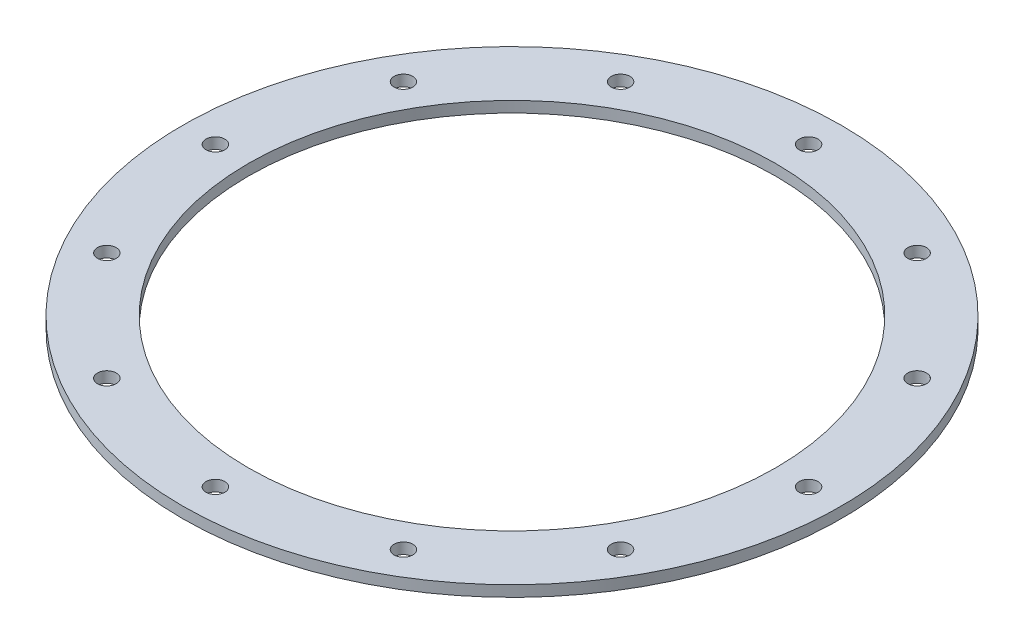
ISO-10303-21;
HEADER;
FILE_DESCRIPTION(('STEP AP214'),'2;1');
FILE_NAME('part.step','',(''),(''),'','','');
FILE_SCHEMA(('AUTOMOTIVE_DESIGN { 1 0 10303 214 1 1 1 1 }'));
ENDSEC;
DATA;
#1=APPLICATION_CONTEXT('core data for automotive mechanical design processes');
#2=APPLICATION_PROTOCOL_DEFINITION('international standard','automotive_design',2000,#1);
#3=PRODUCT_CONTEXT('',#1,'mechanical');
#4=PRODUCT('Part','Part','',(#3));
#5=PRODUCT_RELATED_PRODUCT_CATEGORY('part','',(#4));
#6=PRODUCT_DEFINITION_FORMATION('','',#4);
#7=PRODUCT_DEFINITION_CONTEXT('part definition',#1,'design');
#8=PRODUCT_DEFINITION('design','',#6,#7);
#9=PRODUCT_DEFINITION_SHAPE('','',#8);
#10=(LENGTH_UNIT() NAMED_UNIT(*) SI_UNIT(.MILLI.,.METRE.));
#11=(NAMED_UNIT(*) PLANE_ANGLE_UNIT() SI_UNIT($,.RADIAN.));
#12=(NAMED_UNIT(*) SI_UNIT($,.STERADIAN.) SOLID_ANGLE_UNIT());
#13=UNCERTAINTY_MEASURE_WITH_UNIT(LENGTH_MEASURE(1.E-05),#10,'distance_accuracy_value','');
#14=(GEOMETRIC_REPRESENTATION_CONTEXT(3) GLOBAL_UNCERTAINTY_ASSIGNED_CONTEXT((#13)) GLOBAL_UNIT_ASSIGNED_CONTEXT((#10,
#11,#12)) REPRESENTATION_CONTEXT('',''));
#15=CARTESIAN_POINT('',(0.,0.,0.));
#16=DIRECTION('',(0.,0.,1.));
#17=DIRECTION('',(1.,0.,0.));
#18=AXIS2_PLACEMENT_3D('',#15,#16,#17);
#19=CARTESIAN_POINT('',(-38.1,1.5875,0.));
#20=DIRECTION('',(0.,1.,0.));
#21=DIRECTION('',(0.,0.,1.));
#22=AXIS2_PLACEMENT_3D('',#19,#20,#21);
#23=PLANE('',#22);
#24=CARTESIAN_POINT('',(-21.4312500000004,1.58750000000001,37.1200138697103));
#25=DIRECTION('',(0.,-1.,0.));
#26=DIRECTION('',(0.,0.,-1.));
#27=AXIS2_PLACEMENT_3D('',#24,#25,#26);
#28=CIRCLE('',#27,1.35255);
#29=CARTESIAN_POINT('',(-21.4312500000004,1.58750000000001,35.7674638697103));
#30=VERTEX_POINT('',#29);
#31=EDGE_CURVE('E117',#30,#30,#28,.T.);
#32=ORIENTED_EDGE('',*,*,#31,.T.);
#33=EDGE_LOOP('',(#32));
#34=FACE_BOUND('',#33,.T.);
#35=CARTESIAN_POINT('',(21.4312499999997,1.58750000000001,37.1200138697107));
#36=DIRECTION('',(0.,-1.,0.));
#37=DIRECTION('',(0.,0.,-1.));
#38=AXIS2_PLACEMENT_3D('',#35,#36,#37);
#39=CIRCLE('',#38,1.35255);
#40=CARTESIAN_POINT('',(21.4312499999997,1.58750000000001,35.7674638697107));
#41=VERTEX_POINT('',#40);
#42=EDGE_CURVE('E105',#41,#41,#39,.T.);
#43=ORIENTED_EDGE('',*,*,#42,.T.);
#44=EDGE_LOOP('',(#43));
#45=FACE_BOUND('',#44,.T.);
#46=CARTESIAN_POINT('',(42.8625,1.58750000000001,2.36953774157887E-13));
#47=DIRECTION('',(0.,-1.,0.));
#48=DIRECTION('',(0.,0.,-1.));
#49=AXIS2_PLACEMENT_3D('',#46,#47,#48);
#50=CIRCLE('',#49,1.35255);
#51=CARTESIAN_POINT('',(42.8625,1.58750000000001,-1.35254999999976));
#52=VERTEX_POINT('',#51);
#53=EDGE_CURVE('E93',#52,#52,#50,.T.);
#54=ORIENTED_EDGE('',*,*,#53,.T.);
#55=EDGE_LOOP('',(#54));
#56=FACE_BOUND('',#55,.T.);
#57=CARTESIAN_POINT('',(21.4312500000001,1.58750000000001,-37.1200138697104));
#58=DIRECTION('',(0.,-1.,0.));
#59=DIRECTION('',(0.,0.,-1.));
#60=AXIS2_PLACEMENT_3D('',#57,#58,#59);
#61=CIRCLE('',#60,1.35255);
#62=CARTESIAN_POINT('',(21.4312500000001,1.58750000000001,-38.4725638697104));
#63=VERTEX_POINT('',#62);
#64=EDGE_CURVE('E81',#63,#63,#61,.T.);
#65=ORIENTED_EDGE('',*,*,#64,.T.);
#66=EDGE_LOOP('',(#65));
#67=FACE_BOUND('',#66,.T.);
#68=CARTESIAN_POINT('',(1.15852315907521E-13,1.58750000000001,-42.8625));
#69=DIRECTION('',(0.,-1.,0.));
#70=DIRECTION('',(0.,0.,-1.));
#71=AXIS2_PLACEMENT_3D('',#68,#69,#70);
#72=CIRCLE('',#71,1.35255);
#73=CARTESIAN_POINT('',(1.15852315907521E-13,1.58750000000001,-44.21505));
#74=VERTEX_POINT('',#73);
#75=EDGE_CURVE('E75',#74,#74,#72,.T.);
#76=ORIENTED_EDGE('',*,*,#75,.T.);
#77=EDGE_LOOP('',(#76));
#78=FACE_BOUND('',#77,.T.);
#79=CARTESIAN_POINT('',(-21.4312499999999,1.58750000000001,-37.1200138697105));
#80=DIRECTION('',(0.,-1.,0.));
#81=DIRECTION('',(0.,0.,-1.));
#82=AXIS2_PLACEMENT_3D('',#79,#80,#81);
#83=CIRCLE('',#82,1.35255);
#84=CARTESIAN_POINT('',(-21.4312499999999,1.58750000000001,-38.4725638697105));
#85=VERTEX_POINT('',#84);
#86=EDGE_CURVE('E69',#85,#85,#83,.T.);
#87=ORIENTED_EDGE('',*,*,#86,.T.);
#88=EDGE_LOOP('',(#87));
#89=FACE_BOUND('',#88,.T.);
#90=CARTESIAN_POINT('',(-37.1200138697105,1.58750000000001,-21.43125));
#91=DIRECTION('',(0.,-1.,0.));
#92=DIRECTION('',(0.,0.,-1.));
#93=AXIS2_PLACEMENT_3D('',#90,#91,#92);
#94=CIRCLE('',#93,1.35255);
#95=CARTESIAN_POINT('',(-37.1200138697105,1.58750000000001,-22.7838));
#96=VERTEX_POINT('',#95);
#97=EDGE_CURVE('E63',#96,#96,#94,.T.);
#98=ORIENTED_EDGE('',*,*,#97,.T.);
#99=EDGE_LOOP('',(#98));
#100=FACE_BOUND('',#99,.T.);
#101=CARTESIAN_POINT('',(-42.8625,1.58750000000001,0.));
#102=DIRECTION('',(0.,-1.,0.));
#103=DIRECTION('',(0.,0.,-1.));
#104=AXIS2_PLACEMENT_3D('',#101,#102,#103);
#105=CIRCLE('',#104,1.35255);
#106=CARTESIAN_POINT('',(-42.8625,1.58750000000001,-1.35255));
#107=VERTEX_POINT('',#106);
#108=EDGE_CURVE('E57',#107,#107,#105,.T.);
#109=ORIENTED_EDGE('',*,*,#108,.T.);
#110=EDGE_LOOP('',(#109));
#111=FACE_BOUND('',#110,.T.);
#112=CARTESIAN_POINT('',(0.,1.5875,0.));
#113=DIRECTION('',(0.,1.,0.));
#114=DIRECTION('',(0.,0.,1.));
#115=AXIS2_PLACEMENT_3D('',#112,#113,#114);
#116=CIRCLE('',#115,47.625);
#117=CARTESIAN_POINT('',(0.,1.5875,47.625));
#118=VERTEX_POINT('',#117);
#119=EDGE_CURVE('E44',#118,#118,#116,.T.);
#120=ORIENTED_EDGE('',*,*,#119,.T.);
#121=EDGE_LOOP('',(#120));
#122=FACE_BOUND('',#121,.T.);
#123=CARTESIAN_POINT('',(0.,1.58750000000001,0.));
#124=DIRECTION('',(0.,1.,0.));
#125=DIRECTION('',(0.,0.,1.));
#126=AXIS2_PLACEMENT_3D('',#123,#124,#125);
#127=CIRCLE('',#126,38.1);
#128=CARTESIAN_POINT('',(0.,1.58750000000001,38.1));
#129=VERTEX_POINT('',#128);
#130=EDGE_CURVE('E10',#129,#129,#127,.T.);
#131=ORIENTED_EDGE('',*,*,#130,.F.);
#132=EDGE_LOOP('',(#131));
#133=FACE_BOUND('',#132,.T.);
#134=CARTESIAN_POINT('',(37.1200138697106,1.58750000000001,-21.4312499999998));
#135=DIRECTION('',(0.,-1.,0.));
#136=DIRECTION('',(0.,0.,-1.));
#137=AXIS2_PLACEMENT_3D('',#134,#135,#136);
#138=CIRCLE('',#137,1.35255);
#139=CARTESIAN_POINT('',(37.1200138697106,1.58750000000001,-22.7837999999998));
#140=VERTEX_POINT('',#139);
#141=EDGE_CURVE('E87',#140,#140,#138,.T.);
#142=ORIENTED_EDGE('',*,*,#141,.T.);
#143=EDGE_LOOP('',(#142));
#144=FACE_BOUND('',#143,.T.);
#145=CARTESIAN_POINT('',(37.1200138697104,1.58750000000001,21.4312500000002));
#146=DIRECTION('',(0.,-1.,0.));
#147=DIRECTION('',(0.,0.,-1.));
#148=AXIS2_PLACEMENT_3D('',#145,#146,#147);
#149=CIRCLE('',#148,1.35255);
#150=CARTESIAN_POINT('',(37.1200138697104,1.58750000000001,20.0787000000002));
#151=VERTEX_POINT('',#150);
#152=EDGE_CURVE('E99',#151,#151,#149,.T.);
#153=ORIENTED_EDGE('',*,*,#152,.T.);
#154=EDGE_LOOP('',(#153));
#155=FACE_BOUND('',#154,.T.);
#156=CARTESIAN_POINT('',(-3.67572619286853E-13,1.58750000000001,42.8625));
#157=DIRECTION('',(0.,-1.,0.));
#158=DIRECTION('',(0.,0.,-1.));
#159=AXIS2_PLACEMENT_3D('',#156,#157,#158);
#160=CIRCLE('',#159,1.35255);
#161=CARTESIAN_POINT('',(-3.67572619286853E-13,1.58750000000001,41.50995));
#162=VERTEX_POINT('',#161);
#163=EDGE_CURVE('E111',#162,#162,#160,.T.);
#164=ORIENTED_EDGE('',*,*,#163,.T.);
#165=EDGE_LOOP('',(#164));
#166=FACE_BOUND('',#165,.T.);
#167=CARTESIAN_POINT('',(-37.1200138697107,1.58750000000001,21.4312499999996));
#168=DIRECTION('',(0.,-1.,0.));
#169=DIRECTION('',(0.,0.,-1.));
#170=AXIS2_PLACEMENT_3D('',#167,#168,#169);
#171=CIRCLE('',#170,1.35255);
#172=CARTESIAN_POINT('',(-37.1200138697107,1.58750000000001,20.0786999999996));
#173=VERTEX_POINT('',#172);
#174=EDGE_CURVE('E123',#173,#173,#171,.T.);
#175=ORIENTED_EDGE('',*,*,#174,.T.);
#176=EDGE_LOOP('',(#175));
#177=FACE_BOUND('',#176,.T.);
#178=ADVANCED_FACE('F37',(#34,#45,#56,#67,#78,#89,#100,#111,#122,#133,#144,#155,#166,#177),#23,.T.);
#179=CARTESIAN_POINT('',(0.,55.,0.));
#180=DIRECTION('',(0.,1.,0.));
#181=DIRECTION('',(0.,0.,1.));
#182=AXIS2_PLACEMENT_3D('',#179,#180,#181);
#183=CYLINDRICAL_SURFACE('',#182,38.1);
#184=ORIENTED_EDGE('',*,*,#130,.T.);
#185=EDGE_LOOP('',(#184));
#186=FACE_BOUND('',#185,.T.);
#187=CARTESIAN_POINT('',(0.,0.,0.));
#188=DIRECTION('',(0.,1.,0.));
#189=DIRECTION('',(0.,0.,1.));
#190=AXIS2_PLACEMENT_3D('',#187,#188,#189);
#191=CIRCLE('',#190,38.1);
#192=CARTESIAN_POINT('',(0.,0.,38.1));
#193=VERTEX_POINT('',#192);
#194=EDGE_CURVE('E52',#193,#193,#191,.T.);
#195=ORIENTED_EDGE('',*,*,#194,.F.);
#196=EDGE_LOOP('',(#195));
#197=FACE_BOUND('',#196,.T.);
#198=ADVANCED_FACE('F39',(#186,#197),#183,.F.);
#199=CARTESIAN_POINT('',(0.,55.,0.));
#200=DIRECTION('',(0.,1.,0.));
#201=DIRECTION('',(0.,0.,1.));
#202=AXIS2_PLACEMENT_3D('',#199,#200,#201);
#203=CYLINDRICAL_SURFACE('',#202,47.625);
#204=CARTESIAN_POINT('',(0.,0.,0.));
#205=DIRECTION('',(0.,1.,0.));
#206=DIRECTION('',(0.,0.,1.));
#207=AXIS2_PLACEMENT_3D('',#204,#205,#206);
#208=CIRCLE('',#207,47.625);
#209=CARTESIAN_POINT('',(0.,0.,47.625));
#210=VERTEX_POINT('',#209);
#211=EDGE_CURVE('E48',#210,#210,#208,.T.);
#212=ORIENTED_EDGE('',*,*,#211,.T.);
#213=EDGE_LOOP('',(#212));
#214=FACE_BOUND('',#213,.T.);
#215=ORIENTED_EDGE('',*,*,#119,.F.);
#216=EDGE_LOOP('',(#215));
#217=FACE_BOUND('',#216,.T.);
#218=ADVANCED_FACE('F136',(#214,#217),#203,.T.);
#219=CARTESIAN_POINT('',(-38.1,0.,0.));
#220=DIRECTION('',(0.,-1.,0.));
#221=DIRECTION('',(0.,0.,-1.));
#222=AXIS2_PLACEMENT_3D('',#219,#220,#221);
#223=PLANE('',#222);
#224=CARTESIAN_POINT('',(-37.1200138697107,0.,21.4312499999996));
#225=DIRECTION('',(0.,-1.,0.));
#226=DIRECTION('',(0.,0.,-1.));
#227=AXIS2_PLACEMENT_3D('',#224,#225,#226);
#228=CIRCLE('',#227,1.35255);
#229=CARTESIAN_POINT('',(-37.1200138697107,0.,20.0786999999996));
#230=VERTEX_POINT('',#229);
#231=EDGE_CURVE('E126',#230,#230,#228,.T.);
#232=ORIENTED_EDGE('',*,*,#231,.F.);
#233=EDGE_LOOP('',(#232));
#234=FACE_BOUND('',#233,.T.);
#235=CARTESIAN_POINT('',(-21.4312500000004,0.,37.1200138697103));
#236=DIRECTION('',(0.,-1.,0.));
#237=DIRECTION('',(0.,0.,-1.));
#238=AXIS2_PLACEMENT_3D('',#235,#236,#237);
#239=CIRCLE('',#238,1.35255);
#240=CARTESIAN_POINT('',(-21.4312500000004,0.,35.7674638697103));
#241=VERTEX_POINT('',#240);
#242=EDGE_CURVE('E120',#241,#241,#239,.T.);
#243=ORIENTED_EDGE('',*,*,#242,.F.);
#244=EDGE_LOOP('',(#243));
#245=FACE_BOUND('',#244,.T.);
#246=CARTESIAN_POINT('',(-3.67572619286853E-13,0.,42.8625));
#247=DIRECTION('',(0.,-1.,0.));
#248=DIRECTION('',(0.,0.,-1.));
#249=AXIS2_PLACEMENT_3D('',#246,#247,#248);
#250=CIRCLE('',#249,1.35255);
#251=CARTESIAN_POINT('',(-3.67572619286853E-13,0.,41.50995));
#252=VERTEX_POINT('',#251);
#253=EDGE_CURVE('E114',#252,#252,#250,.T.);
#254=ORIENTED_EDGE('',*,*,#253,.F.);
#255=EDGE_LOOP('',(#254));
#256=FACE_BOUND('',#255,.T.);
#257=CARTESIAN_POINT('',(21.4312499999997,0.,37.1200138697107));
#258=DIRECTION('',(0.,-1.,0.));
#259=DIRECTION('',(0.,0.,-1.));
#260=AXIS2_PLACEMENT_3D('',#257,#258,#259);
#261=CIRCLE('',#260,1.35255);
#262=CARTESIAN_POINT('',(21.4312499999997,0.,35.7674638697107));
#263=VERTEX_POINT('',#262);
#264=EDGE_CURVE('E108',#263,#263,#261,.T.);
#265=ORIENTED_EDGE('',*,*,#264,.F.);
#266=EDGE_LOOP('',(#265));
#267=FACE_BOUND('',#266,.T.);
#268=CARTESIAN_POINT('',(37.1200138697104,0.,21.4312500000002));
#269=DIRECTION('',(0.,-1.,0.));
#270=DIRECTION('',(0.,0.,-1.));
#271=AXIS2_PLACEMENT_3D('',#268,#269,#270);
#272=CIRCLE('',#271,1.35255);
#273=CARTESIAN_POINT('',(37.1200138697104,0.,20.0787000000002));
#274=VERTEX_POINT('',#273);
#275=EDGE_CURVE('E102',#274,#274,#272,.T.);
#276=ORIENTED_EDGE('',*,*,#275,.F.);
#277=EDGE_LOOP('',(#276));
#278=FACE_BOUND('',#277,.T.);
#279=CARTESIAN_POINT('',(42.8625,0.,2.36953774157887E-13));
#280=DIRECTION('',(0.,-1.,0.));
#281=DIRECTION('',(0.,0.,-1.));
#282=AXIS2_PLACEMENT_3D('',#279,#280,#281);
#283=CIRCLE('',#282,1.35255);
#284=CARTESIAN_POINT('',(42.8625,0.,-1.35254999999976));
#285=VERTEX_POINT('',#284);
#286=EDGE_CURVE('E96',#285,#285,#283,.T.);
#287=ORIENTED_EDGE('',*,*,#286,.F.);
#288=EDGE_LOOP('',(#287));
#289=FACE_BOUND('',#288,.T.);
#290=CARTESIAN_POINT('',(37.1200138697106,0.,-21.4312499999998));
#291=DIRECTION('',(0.,-1.,0.));
#292=DIRECTION('',(0.,0.,-1.));
#293=AXIS2_PLACEMENT_3D('',#290,#291,#292);
#294=CIRCLE('',#293,1.35255);
#295=CARTESIAN_POINT('',(37.1200138697106,0.,-22.7837999999998));
#296=VERTEX_POINT('',#295);
#297=EDGE_CURVE('E90',#296,#296,#294,.T.);
#298=ORIENTED_EDGE('',*,*,#297,.F.);
#299=EDGE_LOOP('',(#298));
#300=FACE_BOUND('',#299,.T.);
#301=CARTESIAN_POINT('',(21.4312500000001,0.,-37.1200138697104));
#302=DIRECTION('',(0.,-1.,0.));
#303=DIRECTION('',(0.,0.,-1.));
#304=AXIS2_PLACEMENT_3D('',#301,#302,#303);
#305=CIRCLE('',#304,1.35255);
#306=CARTESIAN_POINT('',(21.4312500000001,0.,-38.4725638697104));
#307=VERTEX_POINT('',#306);
#308=EDGE_CURVE('E84',#307,#307,#305,.T.);
#309=ORIENTED_EDGE('',*,*,#308,.F.);
#310=EDGE_LOOP('',(#309));
#311=FACE_BOUND('',#310,.T.);
#312=CARTESIAN_POINT('',(1.15852315907521E-13,0.,-42.8625));
#313=DIRECTION('',(0.,-1.,0.));
#314=DIRECTION('',(0.,0.,-1.));
#315=AXIS2_PLACEMENT_3D('',#312,#313,#314);
#316=CIRCLE('',#315,1.35255);
#317=CARTESIAN_POINT('',(1.15852315907521E-13,0.,-44.21505));
#318=VERTEX_POINT('',#317);
#319=EDGE_CURVE('E78',#318,#318,#316,.T.);
#320=ORIENTED_EDGE('',*,*,#319,.F.);
#321=EDGE_LOOP('',(#320));
#322=FACE_BOUND('',#321,.T.);
#323=CARTESIAN_POINT('',(-21.4312499999999,0.,-37.1200138697105));
#324=DIRECTION('',(0.,-1.,0.));
#325=DIRECTION('',(0.,0.,-1.));
#326=AXIS2_PLACEMENT_3D('',#323,#324,#325);
#327=CIRCLE('',#326,1.35255);
#328=CARTESIAN_POINT('',(-21.4312499999999,0.,-38.4725638697105));
#329=VERTEX_POINT('',#328);
#330=EDGE_CURVE('E72',#329,#329,#327,.T.);
#331=ORIENTED_EDGE('',*,*,#330,.F.);
#332=EDGE_LOOP('',(#331));
#333=FACE_BOUND('',#332,.T.);
#334=CARTESIAN_POINT('',(-37.1200138697105,0.,-21.43125));
#335=DIRECTION('',(0.,-1.,0.));
#336=DIRECTION('',(0.,0.,-1.));
#337=AXIS2_PLACEMENT_3D('',#334,#335,#336);
#338=CIRCLE('',#337,1.35255);
#339=CARTESIAN_POINT('',(-37.1200138697105,0.,-22.7838));
#340=VERTEX_POINT('',#339);
#341=EDGE_CURVE('E66',#340,#340,#338,.T.);
#342=ORIENTED_EDGE('',*,*,#341,.F.);
#343=EDGE_LOOP('',(#342));
#344=FACE_BOUND('',#343,.T.);
#345=CARTESIAN_POINT('',(-42.8625,0.,0.));
#346=DIRECTION('',(0.,-1.,0.));
#347=DIRECTION('',(0.,0.,-1.));
#348=AXIS2_PLACEMENT_3D('',#345,#346,#347);
#349=CIRCLE('',#348,1.35255);
#350=CARTESIAN_POINT('',(-42.8625,0.,-1.35255));
#351=VERTEX_POINT('',#350);
#352=EDGE_CURVE('E60',#351,#351,#349,.T.);
#353=ORIENTED_EDGE('',*,*,#352,.F.);
#354=EDGE_LOOP('',(#353));
#355=FACE_BOUND('',#354,.T.);
#356=ORIENTED_EDGE('',*,*,#194,.T.);
#357=EDGE_LOOP('',(#356));
#358=FACE_BOUND('',#357,.T.);
#359=ORIENTED_EDGE('',*,*,#211,.F.);
#360=EDGE_LOOP('',(#359));
#361=FACE_BOUND('',#360,.T.);
#362=ADVANCED_FACE('F132',(#234,#245,#256,#267,#278,#289,#300,#311,#322,#333,#344,#355,#358,
#361),#223,.T.);
#363=CARTESIAN_POINT('',(-42.8625,0.,0.));
#364=DIRECTION('',(0.,-1.,0.));
#365=DIRECTION('',(0.,0.,-1.));
#366=AXIS2_PLACEMENT_3D('',#363,#364,#365);
#367=CYLINDRICAL_SURFACE('',#366,1.35255);
#368=ORIENTED_EDGE('',*,*,#108,.F.);
#369=EDGE_LOOP('',(#368));
#370=FACE_BOUND('',#369,.T.);
#371=ORIENTED_EDGE('',*,*,#352,.T.);
#372=EDGE_LOOP('',(#371));
#373=FACE_BOUND('',#372,.T.);
#374=ADVANCED_FACE('F135',(#370,#373),#367,.F.);
#375=CARTESIAN_POINT('',(-37.1200138697105,0.,-21.43125));
#376=DIRECTION('',(0.,-1.,0.));
#377=DIRECTION('',(0.,0.,-1.));
#378=AXIS2_PLACEMENT_3D('',#375,#376,#377);
#379=CYLINDRICAL_SURFACE('',#378,1.35255);
#380=ORIENTED_EDGE('',*,*,#97,.F.);
#381=EDGE_LOOP('',(#380));
#382=FACE_BOUND('',#381,.T.);
#383=ORIENTED_EDGE('',*,*,#341,.T.);
#384=EDGE_LOOP('',(#383));
#385=FACE_BOUND('',#384,.T.);
#386=ADVANCED_FACE('F239',(#382,#385),#379,.F.);
#387=CARTESIAN_POINT('',(-21.4312499999999,0.,-37.1200138697105));
#388=DIRECTION('',(0.,-1.,0.));
#389=DIRECTION('',(0.,0.,-1.));
#390=AXIS2_PLACEMENT_3D('',#387,#388,#389);
#391=CYLINDRICAL_SURFACE('',#390,1.35255);
#392=ORIENTED_EDGE('',*,*,#86,.F.);
#393=EDGE_LOOP('',(#392));
#394=FACE_BOUND('',#393,.T.);
#395=ORIENTED_EDGE('',*,*,#330,.T.);
#396=EDGE_LOOP('',(#395));
#397=FACE_BOUND('',#396,.T.);
#398=ADVANCED_FACE('F235',(#394,#397),#391,.F.);
#399=CARTESIAN_POINT('',(1.15852315907521E-13,0.,-42.8625));
#400=DIRECTION('',(0.,-1.,0.));
#401=DIRECTION('',(0.,0.,-1.));
#402=AXIS2_PLACEMENT_3D('',#399,#400,#401);
#403=CYLINDRICAL_SURFACE('',#402,1.35255);
#404=ORIENTED_EDGE('',*,*,#75,.F.);
#405=EDGE_LOOP('',(#404));
#406=FACE_BOUND('',#405,.T.);
#407=ORIENTED_EDGE('',*,*,#319,.T.);
#408=EDGE_LOOP('',(#407));
#409=FACE_BOUND('',#408,.T.);
#410=ADVANCED_FACE('F231',(#406,#409),#403,.F.);
#411=CARTESIAN_POINT('',(21.4312500000001,0.,-37.1200138697104));
#412=DIRECTION('',(0.,-1.,0.));
#413=DIRECTION('',(0.,0.,-1.));
#414=AXIS2_PLACEMENT_3D('',#411,#412,#413);
#415=CYLINDRICAL_SURFACE('',#414,1.35255);
#416=ORIENTED_EDGE('',*,*,#64,.F.);
#417=EDGE_LOOP('',(#416));
#418=FACE_BOUND('',#417,.T.);
#419=ORIENTED_EDGE('',*,*,#308,.T.);
#420=EDGE_LOOP('',(#419));
#421=FACE_BOUND('',#420,.T.);
#422=ADVANCED_FACE('F227',(#418,#421),#415,.F.);
#423=CARTESIAN_POINT('',(37.1200138697106,0.,-21.4312499999998));
#424=DIRECTION('',(0.,-1.,0.));
#425=DIRECTION('',(0.,0.,-1.));
#426=AXIS2_PLACEMENT_3D('',#423,#424,#425);
#427=CYLINDRICAL_SURFACE('',#426,1.35255);
#428=ORIENTED_EDGE('',*,*,#141,.F.);
#429=EDGE_LOOP('',(#428));
#430=FACE_BOUND('',#429,.T.);
#431=ORIENTED_EDGE('',*,*,#297,.T.);
#432=EDGE_LOOP('',(#431));
#433=FACE_BOUND('',#432,.T.);
#434=ADVANCED_FACE('F223',(#430,#433),#427,.F.);
#435=CARTESIAN_POINT('',(42.8625,0.,2.36953774157887E-13));
#436=DIRECTION('',(0.,-1.,0.));
#437=DIRECTION('',(0.,0.,-1.));
#438=AXIS2_PLACEMENT_3D('',#435,#436,#437);
#439=CYLINDRICAL_SURFACE('',#438,1.35255);
#440=ORIENTED_EDGE('',*,*,#53,.F.);
#441=EDGE_LOOP('',(#440));
#442=FACE_BOUND('',#441,.T.);
#443=ORIENTED_EDGE('',*,*,#286,.T.);
#444=EDGE_LOOP('',(#443));
#445=FACE_BOUND('',#444,.T.);
#446=ADVANCED_FACE('F219',(#442,#445),#439,.F.);
#447=CARTESIAN_POINT('',(37.1200138697104,0.,21.4312500000002));
#448=DIRECTION('',(0.,-1.,0.));
#449=DIRECTION('',(0.,0.,-1.));
#450=AXIS2_PLACEMENT_3D('',#447,#448,#449);
#451=CYLINDRICAL_SURFACE('',#450,1.35255);
#452=ORIENTED_EDGE('',*,*,#152,.F.);
#453=EDGE_LOOP('',(#452));
#454=FACE_BOUND('',#453,.T.);
#455=ORIENTED_EDGE('',*,*,#275,.T.);
#456=EDGE_LOOP('',(#455));
#457=FACE_BOUND('',#456,.T.);
#458=ADVANCED_FACE('F215',(#454,#457),#451,.F.);
#459=CARTESIAN_POINT('',(21.4312499999997,0.,37.1200138697107));
#460=DIRECTION('',(0.,-1.,0.));
#461=DIRECTION('',(0.,0.,-1.));
#462=AXIS2_PLACEMENT_3D('',#459,#460,#461);
#463=CYLINDRICAL_SURFACE('',#462,1.35255);
#464=ORIENTED_EDGE('',*,*,#42,.F.);
#465=EDGE_LOOP('',(#464));
#466=FACE_BOUND('',#465,.T.);
#467=ORIENTED_EDGE('',*,*,#264,.T.);
#468=EDGE_LOOP('',(#467));
#469=FACE_BOUND('',#468,.T.);
#470=ADVANCED_FACE('F211',(#466,#469),#463,.F.);
#471=CARTESIAN_POINT('',(-3.67572619286853E-13,0.,42.8625));
#472=DIRECTION('',(0.,-1.,0.));
#473=DIRECTION('',(0.,0.,-1.));
#474=AXIS2_PLACEMENT_3D('',#471,#472,#473);
#475=CYLINDRICAL_SURFACE('',#474,1.35255);
#476=ORIENTED_EDGE('',*,*,#163,.F.);
#477=EDGE_LOOP('',(#476));
#478=FACE_BOUND('',#477,.T.);
#479=ORIENTED_EDGE('',*,*,#253,.T.);
#480=EDGE_LOOP('',(#479));
#481=FACE_BOUND('',#480,.T.);
#482=ADVANCED_FACE('F205',(#478,#481),#475,.F.);
#483=CARTESIAN_POINT('',(-21.4312500000004,0.,37.1200138697103));
#484=DIRECTION('',(0.,-1.,0.));
#485=DIRECTION('',(0.,0.,-1.));
#486=AXIS2_PLACEMENT_3D('',#483,#484,#485);
#487=CYLINDRICAL_SURFACE('',#486,1.35255);
#488=ORIENTED_EDGE('',*,*,#31,.F.);
#489=EDGE_LOOP('',(#488));
#490=FACE_BOUND('',#489,.T.);
#491=ORIENTED_EDGE('',*,*,#242,.T.);
#492=EDGE_LOOP('',(#491));
#493=FACE_BOUND('',#492,.T.);
#494=ADVANCED_FACE('F200',(#490,#493),#487,.F.);
#495=CARTESIAN_POINT('',(-37.1200138697107,0.,21.4312499999996));
#496=DIRECTION('',(0.,-1.,0.));
#497=DIRECTION('',(0.,0.,-1.));
#498=AXIS2_PLACEMENT_3D('',#495,#496,#497);
#499=CYLINDRICAL_SURFACE('',#498,1.35255);
#500=ORIENTED_EDGE('',*,*,#174,.F.);
#501=EDGE_LOOP('',(#500));
#502=FACE_BOUND('',#501,.T.);
#503=ORIENTED_EDGE('',*,*,#231,.T.);
#504=EDGE_LOOP('',(#503));
#505=FACE_BOUND('',#504,.T.);
#506=ADVANCED_FACE('F130',(#502,#505),#499,.F.);
#507=CLOSED_SHELL('',(#178,#198,#218,#362,#374,#386,#398,#410,#422,#434,#446,#458,#470,#482,
#494,#506));
#508=MANIFOLD_SOLID_BREP('B2',#507);
#509=ADVANCED_BREP_SHAPE_REPRESENTATION('',(#18,#508),#14);
#510=SHAPE_DEFINITION_REPRESENTATION(#9,#509);
ENDSEC;
END-ISO-10303-21;
